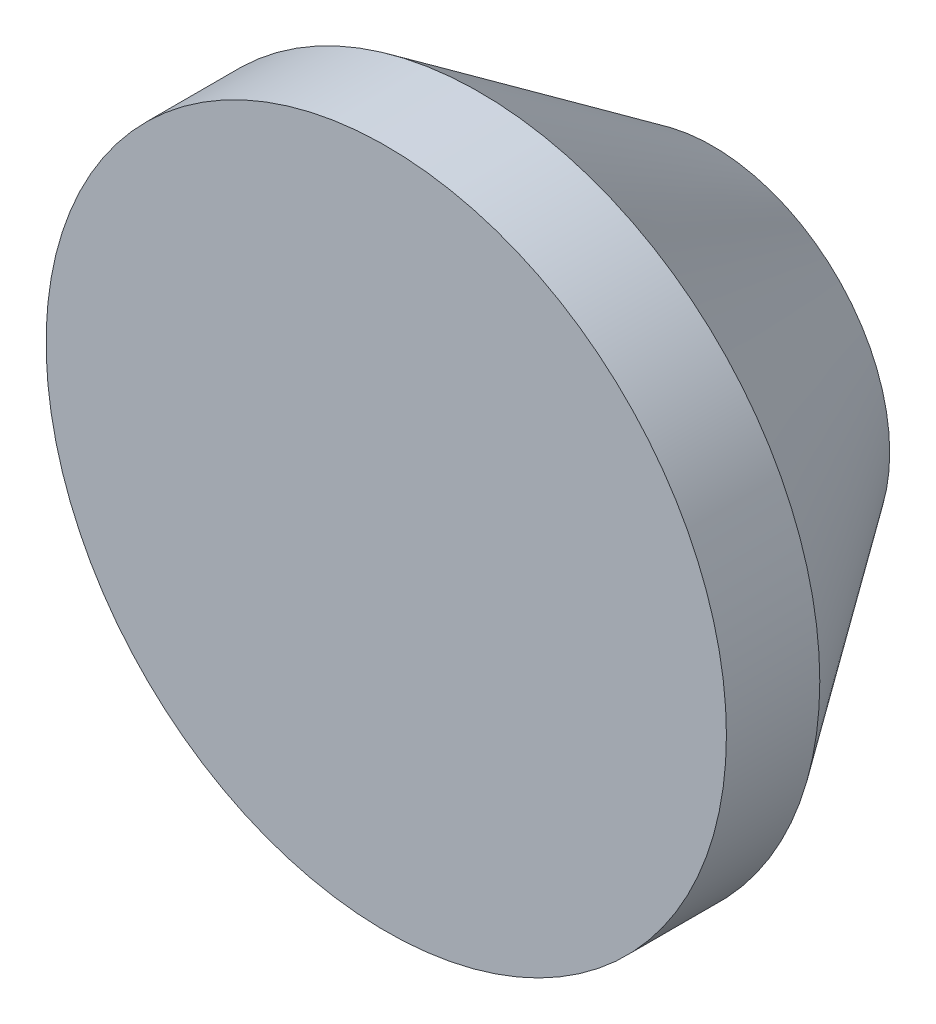
ISO-10303-21;
HEADER;
FILE_DESCRIPTION(('STEP AP214'),'2;1');
FILE_NAME('part.step','',(''),(''),'','','');
FILE_SCHEMA(('AUTOMOTIVE_DESIGN { 1 0 10303 214 1 1 1 1 }'));
ENDSEC;
DATA;
#1=APPLICATION_CONTEXT('core data for automotive mechanical design processes');
#2=APPLICATION_PROTOCOL_DEFINITION('international standard','automotive_design',2000,#1);
#3=PRODUCT_CONTEXT('',#1,'mechanical');
#4=PRODUCT('Part','Part','',(#3));
#5=PRODUCT_RELATED_PRODUCT_CATEGORY('part','',(#4));
#6=PRODUCT_DEFINITION_FORMATION('','',#4);
#7=PRODUCT_DEFINITION_CONTEXT('part definition',#1,'design');
#8=PRODUCT_DEFINITION('design','',#6,#7);
#9=PRODUCT_DEFINITION_SHAPE('','',#8);
#10=(LENGTH_UNIT() NAMED_UNIT(*) SI_UNIT(.MILLI.,.METRE.));
#11=(NAMED_UNIT(*) PLANE_ANGLE_UNIT() SI_UNIT($,.RADIAN.));
#12=(NAMED_UNIT(*) SI_UNIT($,.STERADIAN.) SOLID_ANGLE_UNIT());
#13=UNCERTAINTY_MEASURE_WITH_UNIT(LENGTH_MEASURE(1.E-05),#10,'distance_accuracy_value','');
#14=(GEOMETRIC_REPRESENTATION_CONTEXT(3) GLOBAL_UNCERTAINTY_ASSIGNED_CONTEXT((#13)) GLOBAL_UNIT_ASSIGNED_CONTEXT((#10,
#11,#12)) REPRESENTATION_CONTEXT('',''));
#15=CARTESIAN_POINT('',(0.,0.,0.));
#16=DIRECTION('',(0.,0.,1.));
#17=DIRECTION('',(1.,0.,0.));
#18=AXIS2_PLACEMENT_3D('',#15,#16,#17);
#19=CARTESIAN_POINT('',(0.,0.,12.));
#20=DIRECTION('',(0.,0.,-1.));
#21=DIRECTION('',(-1.,0.,0.));
#22=AXIS2_PLACEMENT_3D('',#19,#20,#21);
#23=CYLINDRICAL_SURFACE('',#22,3.);
#24=CARTESIAN_POINT('',(0.,0.,0.));
#25=DIRECTION('',(0.,0.,1.));
#26=DIRECTION('',(1.,0.,0.));
#27=AXIS2_PLACEMENT_3D('',#24,#25,#26);
#28=CIRCLE('',#27,3.);
#29=CARTESIAN_POINT('',(3.,0.,0.));
#30=VERTEX_POINT('',#29);
#31=EDGE_CURVE('E46',#30,#30,#28,.T.);
#32=ORIENTED_EDGE('',*,*,#31,.F.);
#33=EDGE_LOOP('',(#32));
#34=FACE_BOUND('',#33,.T.);
#35=CARTESIAN_POINT('',(0.,0.,11.));
#36=DIRECTION('',(0.,0.,1.));
#37=DIRECTION('',(1.,0.,0.));
#38=AXIS2_PLACEMENT_3D('',#35,#36,#37);
#39=CIRCLE('',#38,3.);
#40=CARTESIAN_POINT('',(3.,0.,11.));
#41=VERTEX_POINT('',#40);
#42=EDGE_CURVE('E51',#41,#41,#39,.T.);
#43=ORIENTED_EDGE('',*,*,#42,.T.);
#44=EDGE_LOOP('',(#43));
#45=FACE_BOUND('',#44,.T.);
#46=ADVANCED_FACE('F31',(#34,#45),#23,.F.);
#47=CARTESIAN_POINT('',(0.,0.,12.));
#48=DIRECTION('',(0.,0.,1.));
#49=DIRECTION('',(1.,0.,0.));
#50=AXIS2_PLACEMENT_3D('',#47,#48,#49);
#51=PLANE('',#50);
#52=CARTESIAN_POINT('',(0.,0.,12.));
#53=DIRECTION('',(0.,0.,1.));
#54=DIRECTION('',(1.,0.,0.));
#55=AXIS2_PLACEMENT_3D('',#52,#53,#54);
#56=CIRCLE('',#55,12.5);
#57=CARTESIAN_POINT('',(12.5,0.,12.));
#58=VERTEX_POINT('',#57);
#59=EDGE_CURVE('E42',#58,#58,#56,.T.);
#60=ORIENTED_EDGE('',*,*,#59,.T.);
#61=EDGE_LOOP('',(#60));
#62=FACE_BOUND('',#61,.T.);
#63=ADVANCED_FACE('F68',(#62),#51,.T.);
#64=CARTESIAN_POINT('',(0.,0.,0.));
#65=DIRECTION('',(0.,0.,1.));
#66=DIRECTION('',(1.,0.,0.));
#67=AXIS2_PLACEMENT_3D('',#64,#65,#66);
#68=PLANE('',#67);
#69=CARTESIAN_POINT('',(0.,0.,0.));
#70=DIRECTION('',(0.,0.,1.));
#71=DIRECTION('',(1.,0.,0.));
#72=AXIS2_PLACEMENT_3D('',#69,#70,#71);
#73=CIRCLE('',#72,6.49999999999998);
#74=CARTESIAN_POINT('',(6.49999999999998,0.,0.));
#75=VERTEX_POINT('',#74);
#76=EDGE_CURVE('E10',#75,#75,#73,.F.);
#77=ORIENTED_EDGE('',*,*,#76,.T.);
#78=EDGE_LOOP('',(#77));
#79=FACE_BOUND('',#78,.T.);
#80=ORIENTED_EDGE('',*,*,#31,.T.);
#81=EDGE_LOOP('',(#80));
#82=FACE_BOUND('',#81,.T.);
#83=ADVANCED_FACE('F65',(#79,#82),#68,.F.);
#84=CARTESIAN_POINT('',(0.,0.,12.));
#85=DIRECTION('',(0.,0.,-1.));
#86=DIRECTION('',(-1.,0.,0.));
#87=AXIS2_PLACEMENT_3D('',#84,#85,#86);
#88=CYLINDRICAL_SURFACE('',#87,12.5);
#89=CARTESIAN_POINT('',(0.,0.,8.56888804045268));
#90=DIRECTION('',(0.,0.,1.));
#91=DIRECTION('',(1.,0.,0.));
#92=AXIS2_PLACEMENT_3D('',#89,#90,#91);
#93=CIRCLE('',#92,12.5);
#94=CARTESIAN_POINT('',(12.5,0.,8.56888804045268));
#95=VERTEX_POINT('',#94);
#96=EDGE_CURVE('E38',#95,#95,#93,.T.);
#97=ORIENTED_EDGE('',*,*,#96,.T.);
#98=EDGE_LOOP('',(#97));
#99=FACE_BOUND('',#98,.T.);
#100=ORIENTED_EDGE('',*,*,#59,.F.);
#101=EDGE_LOOP('',(#100));
#102=FACE_BOUND('',#101,.T.);
#103=ADVANCED_FACE('F58',(#99,#102),#88,.T.);
#104=CARTESIAN_POINT('',(0.,0.,11.));
#105=DIRECTION('',(0.,0.,1.));
#106=DIRECTION('',(1.,0.,0.));
#107=AXIS2_PLACEMENT_3D('',#104,#105,#106);
#108=PLANE('',#107);
#109=ORIENTED_EDGE('',*,*,#42,.F.);
#110=EDGE_LOOP('',(#109));
#111=FACE_BOUND('',#110,.T.);
#112=ADVANCED_FACE('F56',(#111),#108,.F.);
#113=CARTESIAN_POINT('',(0.,0.,8.56888804045268));
#114=DIRECTION('',(0.,0.,1.));
#115=DIRECTION('',(1.,0.,0.));
#116=AXIS2_PLACEMENT_3D('',#113,#114,#115);
#117=CONICAL_SURFACE('',#116,12.5,0.610865238198017);
#118=ORIENTED_EDGE('',*,*,#76,.F.);
#119=EDGE_LOOP('',(#118));
#120=FACE_BOUND('',#119,.T.);
#121=ORIENTED_EDGE('',*,*,#96,.F.);
#122=EDGE_LOOP('',(#121));
#123=FACE_BOUND('',#122,.T.);
#124=ADVANCED_FACE('F33',(#120,#123),#117,.T.);
#125=CLOSED_SHELL('',(#46,#63,#83,#103,#112,#124));
#126=MANIFOLD_SOLID_BREP('B2',#125);
#127=ADVANCED_BREP_SHAPE_REPRESENTATION('',(#18,#126),#14);
#128=SHAPE_DEFINITION_REPRESENTATION(#9,#127);
ENDSEC;
END-ISO-10303-21;
